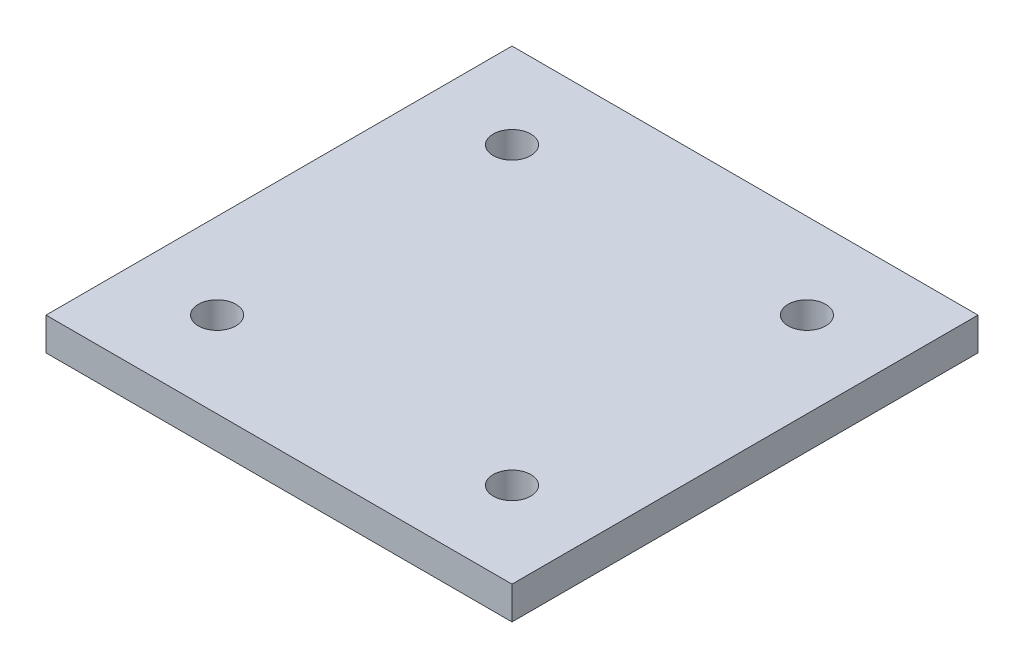
ISO-10303-21;
HEADER;
FILE_DESCRIPTION(('STEP AP214'),'2;1');
FILE_NAME('part.step','',(''),(''),'','','');
FILE_SCHEMA(('AUTOMOTIVE_DESIGN { 1 0 10303 214 1 1 1 1 }'));
ENDSEC;
DATA;
#1=APPLICATION_CONTEXT('core data for automotive mechanical design processes');
#2=APPLICATION_PROTOCOL_DEFINITION('international standard','automotive_design',2000,#1);
#3=PRODUCT_CONTEXT('',#1,'mechanical');
#4=PRODUCT('Part','Part','',(#3));
#5=PRODUCT_RELATED_PRODUCT_CATEGORY('part','',(#4));
#6=PRODUCT_DEFINITION_FORMATION('','',#4);
#7=PRODUCT_DEFINITION_CONTEXT('part definition',#1,'design');
#8=PRODUCT_DEFINITION('design','',#6,#7);
#9=PRODUCT_DEFINITION_SHAPE('','',#8);
#10=(LENGTH_UNIT() NAMED_UNIT(*) SI_UNIT(.MILLI.,.METRE.));
#11=(NAMED_UNIT(*) PLANE_ANGLE_UNIT() SI_UNIT($,.RADIAN.));
#12=(NAMED_UNIT(*) SI_UNIT($,.STERADIAN.) SOLID_ANGLE_UNIT());
#13=UNCERTAINTY_MEASURE_WITH_UNIT(LENGTH_MEASURE(1.E-05),#10,'distance_accuracy_value','');
#14=(GEOMETRIC_REPRESENTATION_CONTEXT(3) GLOBAL_UNCERTAINTY_ASSIGNED_CONTEXT((#13)) GLOBAL_UNIT_ASSIGNED_CONTEXT((#10,
#11,#12)) REPRESENTATION_CONTEXT('',''));
#15=CARTESIAN_POINT('',(0.,0.,0.));
#16=DIRECTION('',(0.,0.,1.));
#17=DIRECTION('',(1.,0.,0.));
#18=AXIS2_PLACEMENT_3D('',#15,#16,#17);
#19=CARTESIAN_POINT('',(0.,2.,0.));
#20=DIRECTION('',(0.,1.,0.));
#21=DIRECTION('',(0.,0.,1.));
#22=AXIS2_PLACEMENT_3D('',#19,#20,#21);
#23=PLANE('',#22);
#24=CARTESIAN_POINT('',(8.99999999999999,2.,9.));
#25=DIRECTION('',(0.,1.,0.));
#26=DIRECTION('',(0.,0.,1.));
#27=AXIS2_PLACEMENT_3D('',#24,#25,#26);
#28=CIRCLE('',#27,1.1462255868277);
#29=CARTESIAN_POINT('',(8.99999999999999,2.,10.1462255868277));
#30=VERTEX_POINT('',#29);
#31=EDGE_CURVE('E121',#30,#30,#28,.T.);
#32=ORIENTED_EDGE('',*,*,#31,.F.);
#33=EDGE_LOOP('',(#32));
#34=FACE_BOUND('',#33,.T.);
#35=CARTESIAN_POINT('',(-9.,2.,-8.99999999999999));
#36=DIRECTION('',(0.,1.,0.));
#37=DIRECTION('',(0.,0.,1.));
#38=AXIS2_PLACEMENT_3D('',#35,#36,#37);
#39=CIRCLE('',#38,1.1462255868277);
#40=CARTESIAN_POINT('',(-9.,2.,-7.8537744131723));
#41=VERTEX_POINT('',#40);
#42=EDGE_CURVE('E100',#41,#41,#39,.T.);
#43=ORIENTED_EDGE('',*,*,#42,.F.);
#44=EDGE_LOOP('',(#43));
#45=FACE_BOUND('',#44,.T.);
#46=DIRECTION('',(0.,0.,1.));
#47=VECTOR('',#46,1.);
#48=CARTESIAN_POINT('',(-14.2215425612055,2.,14.2215425612055));
#49=LINE('',#48,#47);
#50=CARTESIAN_POINT('',(-14.2215425612055,2.,-14.2215425612055));
#51=VERTEX_POINT('',#50);
#52=CARTESIAN_POINT('',(-14.2215425612055,2.,14.2215425612055));
#53=VERTEX_POINT('',#52);
#54=EDGE_CURVE('E85',#51,#53,#49,.T.);
#55=ORIENTED_EDGE('',*,*,#54,.T.);
#56=DIRECTION('',(1.,0.,0.));
#57=VECTOR('',#56,1.);
#58=CARTESIAN_POINT('',(14.2215425612055,2.,14.2215425612055));
#59=LINE('',#58,#57);
#60=CARTESIAN_POINT('',(14.2215425612055,2.,14.2215425612055));
#61=VERTEX_POINT('',#60);
#62=EDGE_CURVE('E80',#53,#61,#59,.T.);
#63=ORIENTED_EDGE('',*,*,#62,.T.);
#64=DIRECTION('',(0.,0.,-1.));
#65=VECTOR('',#64,1.);
#66=CARTESIAN_POINT('',(14.2215425612055,2.,14.2215425612055));
#67=LINE('',#66,#65);
#68=CARTESIAN_POINT('',(14.2215425612055,2.,-14.2215425612055));
#69=VERTEX_POINT('',#68);
#70=EDGE_CURVE('E83',#61,#69,#67,.T.);
#71=ORIENTED_EDGE('',*,*,#70,.T.);
#72=DIRECTION('',(-1.,0.,0.));
#73=VECTOR('',#72,1.);
#74=CARTESIAN_POINT('',(14.2215425612055,2.,-14.2215425612055));
#75=LINE('',#74,#73);
#76=EDGE_CURVE('E50',#69,#51,#75,.T.);
#77=ORIENTED_EDGE('',*,*,#76,.T.);
#78=EDGE_LOOP('',(#55,#63,#71,#77));
#79=FACE_BOUND('',#78,.T.);
#80=CARTESIAN_POINT('',(8.99999999999999,2.,-9.));
#81=DIRECTION('',(0.,1.,0.));
#82=DIRECTION('',(0.,0.,-1.));
#83=AXIS2_PLACEMENT_3D('',#80,#81,#82);
#84=CIRCLE('',#83,1.1462255868277);
#85=CARTESIAN_POINT('',(8.99999999999999,2.,-10.1462255868277));
#86=VERTEX_POINT('',#85);
#87=EDGE_CURVE('E115',#86,#86,#84,.T.);
#88=ORIENTED_EDGE('',*,*,#87,.F.);
#89=EDGE_LOOP('',(#88));
#90=FACE_BOUND('',#89,.T.);
#91=CARTESIAN_POINT('',(-8.99999999999999,2.,9.00000000000001));
#92=DIRECTION('',(0.,1.,0.));
#93=DIRECTION('',(0.,0.,-1.));
#94=AXIS2_PLACEMENT_3D('',#91,#92,#93);
#95=CIRCLE('',#94,1.1462255868277);
#96=CARTESIAN_POINT('',(-8.99999999999999,2.,7.85377441317231));
#97=VERTEX_POINT('',#96);
#98=EDGE_CURVE('E127',#97,#97,#95,.T.);
#99=ORIENTED_EDGE('',*,*,#98,.F.);
#100=EDGE_LOOP('',(#99));
#101=FACE_BOUND('',#100,.T.);
#102=ADVANCED_FACE('F33',(#34,#45,#79,#90,#101),#23,.T.);
#103=CARTESIAN_POINT('',(0.,0.,0.));
#104=DIRECTION('',(0.,1.,0.));
#105=DIRECTION('',(0.,0.,1.));
#106=AXIS2_PLACEMENT_3D('',#103,#104,#105);
#107=PLANE('',#106);
#108=CARTESIAN_POINT('',(8.99999999999999,0.,9.));
#109=DIRECTION('',(0.,1.,0.));
#110=DIRECTION('',(0.,0.,1.));
#111=AXIS2_PLACEMENT_3D('',#108,#109,#110);
#112=CIRCLE('',#111,1.1462255868277);
#113=CARTESIAN_POINT('',(8.99999999999999,0.,10.1462255868277));
#114=VERTEX_POINT('',#113);
#115=EDGE_CURVE('E124',#114,#114,#112,.T.);
#116=ORIENTED_EDGE('',*,*,#115,.T.);
#117=EDGE_LOOP('',(#116));
#118=FACE_BOUND('',#117,.T.);
#119=CARTESIAN_POINT('',(-9.,0.,-8.99999999999999));
#120=DIRECTION('',(0.,1.,0.));
#121=DIRECTION('',(0.,0.,1.));
#122=AXIS2_PLACEMENT_3D('',#119,#120,#121);
#123=CIRCLE('',#122,1.1462255868277);
#124=CARTESIAN_POINT('',(-9.,0.,-7.8537744131723));
#125=VERTEX_POINT('',#124);
#126=EDGE_CURVE('E112',#125,#125,#123,.T.);
#127=ORIENTED_EDGE('',*,*,#126,.T.);
#128=EDGE_LOOP('',(#127));
#129=FACE_BOUND('',#128,.T.);
#130=DIRECTION('',(0.,0.,1.));
#131=VECTOR('',#130,1.);
#132=CARTESIAN_POINT('',(-14.2215425612055,0.,14.2215425612055));
#133=LINE('',#132,#131);
#134=CARTESIAN_POINT('',(-14.2215425612055,0.,-14.2215425612055));
#135=VERTEX_POINT('',#134);
#136=CARTESIAN_POINT('',(-14.2215425612055,0.,14.2215425612055));
#137=VERTEX_POINT('',#136);
#138=EDGE_CURVE('E97',#135,#137,#133,.T.);
#139=ORIENTED_EDGE('',*,*,#138,.F.);
#140=DIRECTION('',(-1.,0.,0.));
#141=VECTOR('',#140,1.);
#142=CARTESIAN_POINT('',(14.2215425612055,0.,-14.2215425612055));
#143=LINE('',#142,#141);
#144=CARTESIAN_POINT('',(14.2215425612055,0.,-14.2215425612055));
#145=VERTEX_POINT('',#144);
#146=EDGE_CURVE('E73',#145,#135,#143,.T.);
#147=ORIENTED_EDGE('',*,*,#146,.F.);
#148=DIRECTION('',(0.,0.,-1.));
#149=VECTOR('',#148,1.);
#150=CARTESIAN_POINT('',(14.2215425612055,0.,14.2215425612055));
#151=LINE('',#150,#149);
#152=CARTESIAN_POINT('',(14.2215425612055,0.,14.2215425612055));
#153=VERTEX_POINT('',#152);
#154=EDGE_CURVE('E67',#153,#145,#151,.T.);
#155=ORIENTED_EDGE('',*,*,#154,.F.);
#156=DIRECTION('',(1.,0.,0.));
#157=VECTOR('',#156,1.);
#158=CARTESIAN_POINT('',(14.2215425612055,0.,14.2215425612055));
#159=LINE('',#158,#157);
#160=EDGE_CURVE('E89',#137,#153,#159,.T.);
#161=ORIENTED_EDGE('',*,*,#160,.F.);
#162=EDGE_LOOP('',(#139,#147,#155,#161));
#163=FACE_BOUND('',#162,.T.);
#164=CARTESIAN_POINT('',(8.99999999999999,0.,-9.));
#165=DIRECTION('',(0.,1.,0.));
#166=DIRECTION('',(0.,0.,-1.));
#167=AXIS2_PLACEMENT_3D('',#164,#165,#166);
#168=CIRCLE('',#167,1.1462255868277);
#169=CARTESIAN_POINT('',(8.99999999999999,0.,-10.1462255868277));
#170=VERTEX_POINT('',#169);
#171=EDGE_CURVE('E118',#170,#170,#168,.T.);
#172=ORIENTED_EDGE('',*,*,#171,.T.);
#173=EDGE_LOOP('',(#172));
#174=FACE_BOUND('',#173,.T.);
#175=CARTESIAN_POINT('',(-8.99999999999999,0.,9.00000000000001));
#176=DIRECTION('',(0.,1.,0.));
#177=DIRECTION('',(0.,0.,-1.));
#178=AXIS2_PLACEMENT_3D('',#175,#176,#177);
#179=CIRCLE('',#178,1.1462255868277);
#180=CARTESIAN_POINT('',(-8.99999999999999,0.,7.85377441317231));
#181=VERTEX_POINT('',#180);
#182=EDGE_CURVE('E130',#181,#181,#179,.T.);
#183=ORIENTED_EDGE('',*,*,#182,.T.);
#184=EDGE_LOOP('',(#183));
#185=FACE_BOUND('',#184,.T.);
#186=ADVANCED_FACE('F108',(#118,#129,#163,#174,#185),#107,.F.);
#187=CARTESIAN_POINT('',(-14.2215425612055,2.,14.2215425612055));
#188=DIRECTION('',(1.,0.,0.));
#189=DIRECTION('',(0.,0.,-1.));
#190=AXIS2_PLACEMENT_3D('',#187,#188,#189);
#191=PLANE('',#190);
#192=ORIENTED_EDGE('',*,*,#138,.T.);
#193=DIRECTION('',(0.,-1.,0.));
#194=VECTOR('',#193,1.);
#195=CARTESIAN_POINT('',(-14.2215425612055,2.,14.2215425612055));
#196=LINE('',#195,#194);
#197=EDGE_CURVE('E11',#53,#137,#196,.T.);
#198=ORIENTED_EDGE('',*,*,#197,.F.);
#199=ORIENTED_EDGE('',*,*,#54,.F.);
#200=DIRECTION('',(0.,-1.,0.));
#201=VECTOR('',#200,1.);
#202=CARTESIAN_POINT('',(-14.2215425612055,2.,-14.2215425612055));
#203=LINE('',#202,#201);
#204=EDGE_CURVE('E93',#51,#135,#203,.T.);
#205=ORIENTED_EDGE('',*,*,#204,.T.);
#206=EDGE_LOOP('',(#192,#198,#199,#205));
#207=FACE_BOUND('',#206,.T.);
#208=ADVANCED_FACE('F35',(#207),#191,.F.);
#209=CARTESIAN_POINT('',(14.2215425612055,2.,14.2215425612055));
#210=DIRECTION('',(0.,0.,-1.));
#211=DIRECTION('',(-1.,0.,0.));
#212=AXIS2_PLACEMENT_3D('',#209,#210,#211);
#213=PLANE('',#212);
#214=ORIENTED_EDGE('',*,*,#160,.T.);
#215=DIRECTION('',(0.,-1.,0.));
#216=VECTOR('',#215,1.);
#217=CARTESIAN_POINT('',(14.2215425612055,2.,14.2215425612055));
#218=LINE('',#217,#216);
#219=EDGE_CURVE('E42',#61,#153,#218,.T.);
#220=ORIENTED_EDGE('',*,*,#219,.F.);
#221=ORIENTED_EDGE('',*,*,#62,.F.);
#222=ORIENTED_EDGE('',*,*,#197,.T.);
#223=EDGE_LOOP('',(#214,#220,#221,#222));
#224=FACE_BOUND('',#223,.T.);
#225=ADVANCED_FACE('F88',(#224),#213,.F.);
#226=CARTESIAN_POINT('',(14.2215425612055,2.,14.2215425612055));
#227=DIRECTION('',(-1.,0.,0.));
#228=DIRECTION('',(0.,0.,1.));
#229=AXIS2_PLACEMENT_3D('',#226,#227,#228);
#230=PLANE('',#229);
#231=ORIENTED_EDGE('',*,*,#154,.T.);
#232=DIRECTION('',(0.,-1.,0.));
#233=VECTOR('',#232,1.);
#234=CARTESIAN_POINT('',(14.2215425612055,2.,-14.2215425612055));
#235=LINE('',#234,#233);
#236=EDGE_CURVE('E90',#69,#145,#235,.T.);
#237=ORIENTED_EDGE('',*,*,#236,.F.);
#238=ORIENTED_EDGE('',*,*,#70,.F.);
#239=ORIENTED_EDGE('',*,*,#219,.T.);
#240=EDGE_LOOP('',(#231,#237,#238,#239));
#241=FACE_BOUND('',#240,.T.);
#242=ADVANCED_FACE('F91',(#241),#230,.F.);
#243=CARTESIAN_POINT('',(14.2215425612055,2.,-14.2215425612055));
#244=DIRECTION('',(0.,0.,1.));
#245=DIRECTION('',(1.,0.,0.));
#246=AXIS2_PLACEMENT_3D('',#243,#244,#245);
#247=PLANE('',#246);
#248=ORIENTED_EDGE('',*,*,#146,.T.);
#249=ORIENTED_EDGE('',*,*,#204,.F.);
#250=ORIENTED_EDGE('',*,*,#76,.F.);
#251=ORIENTED_EDGE('',*,*,#236,.T.);
#252=EDGE_LOOP('',(#248,#249,#250,#251));
#253=FACE_BOUND('',#252,.T.);
#254=ADVANCED_FACE('F105',(#253),#247,.F.);
#255=CARTESIAN_POINT('',(-9.,2.,-8.99999999999999));
#256=DIRECTION('',(0.,-1.,0.));
#257=DIRECTION('',(0.,0.,-1.));
#258=AXIS2_PLACEMENT_3D('',#255,#256,#257);
#259=CYLINDRICAL_SURFACE('',#258,1.1462255868277);
#260=ORIENTED_EDGE('',*,*,#42,.T.);
#261=EDGE_LOOP('',(#260));
#262=FACE_BOUND('',#261,.T.);
#263=ORIENTED_EDGE('',*,*,#126,.F.);
#264=EDGE_LOOP('',(#263));
#265=FACE_BOUND('',#264,.T.);
#266=ADVANCED_FACE('F150',(#262,#265),#259,.F.);
#267=CARTESIAN_POINT('',(8.99999999999999,2.,-9.));
#268=DIRECTION('',(0.,-1.,0.));
#269=DIRECTION('',(0.,0.,-1.));
#270=AXIS2_PLACEMENT_3D('',#267,#268,#269);
#271=CYLINDRICAL_SURFACE('',#270,1.1462255868277);
#272=ORIENTED_EDGE('',*,*,#87,.T.);
#273=EDGE_LOOP('',(#272));
#274=FACE_BOUND('',#273,.T.);
#275=ORIENTED_EDGE('',*,*,#171,.F.);
#276=EDGE_LOOP('',(#275));
#277=FACE_BOUND('',#276,.T.);
#278=ADVANCED_FACE('F196',(#274,#277),#271,.F.);
#279=CARTESIAN_POINT('',(8.99999999999999,2.,9.));
#280=DIRECTION('',(0.,-1.,0.));
#281=DIRECTION('',(0.,0.,-1.));
#282=AXIS2_PLACEMENT_3D('',#279,#280,#281);
#283=CYLINDRICAL_SURFACE('',#282,1.1462255868277);
#284=ORIENTED_EDGE('',*,*,#31,.T.);
#285=EDGE_LOOP('',(#284));
#286=FACE_BOUND('',#285,.T.);
#287=ORIENTED_EDGE('',*,*,#115,.F.);
#288=EDGE_LOOP('',(#287));
#289=FACE_BOUND('',#288,.T.);
#290=ADVANCED_FACE('F204',(#286,#289),#283,.F.);
#291=CARTESIAN_POINT('',(-8.99999999999999,2.,9.00000000000001));
#292=DIRECTION('',(0.,-1.,0.));
#293=DIRECTION('',(0.,0.,-1.));
#294=AXIS2_PLACEMENT_3D('',#291,#292,#293);
#295=CYLINDRICAL_SURFACE('',#294,1.1462255868277);
#296=ORIENTED_EDGE('',*,*,#98,.T.);
#297=EDGE_LOOP('',(#296));
#298=FACE_BOUND('',#297,.T.);
#299=ORIENTED_EDGE('',*,*,#182,.F.);
#300=EDGE_LOOP('',(#299));
#301=FACE_BOUND('',#300,.T.);
#302=ADVANCED_FACE('F136',(#298,#301),#295,.F.);
#303=CLOSED_SHELL('',(#102,#186,#208,#225,#242,#254,#266,#278,#290,#302));
#304=MANIFOLD_SOLID_BREP('B2',#303);
#305=ADVANCED_BREP_SHAPE_REPRESENTATION('',(#18,#304),#14);
#306=SHAPE_DEFINITION_REPRESENTATION(#9,#305);
ENDSEC;
END-ISO-10303-21;
